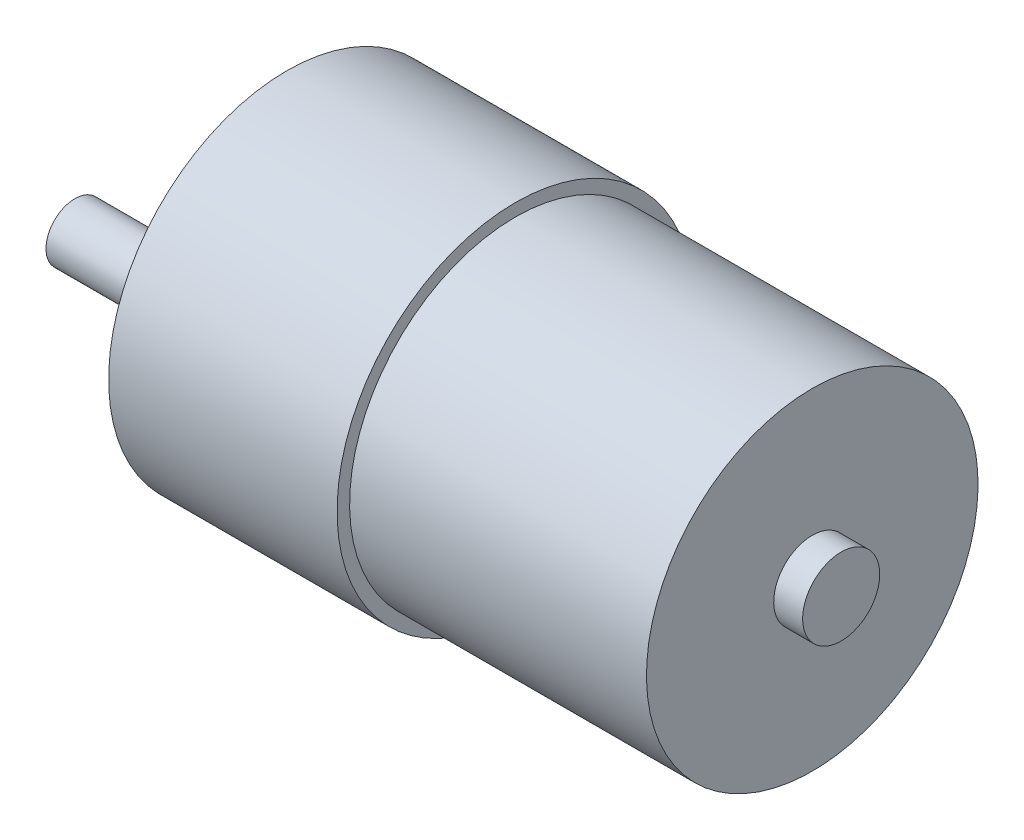
ISO-10303-21;
HEADER;
FILE_DESCRIPTION(('STEP AP214'),'2;1');
FILE_NAME('part.step','',(''),(''),'','','');
FILE_SCHEMA(('AUTOMOTIVE_DESIGN { 1 0 10303 214 1 1 1 1 }'));
ENDSEC;
DATA;
#1=APPLICATION_CONTEXT('core data for automotive mechanical design processes');
#2=APPLICATION_PROTOCOL_DEFINITION('international standard','automotive_design',2000,#1);
#3=PRODUCT_CONTEXT('',#1,'mechanical');
#4=PRODUCT('Part','Part','',(#3));
#5=PRODUCT_RELATED_PRODUCT_CATEGORY('part','',(#4));
#6=PRODUCT_DEFINITION_FORMATION('','',#4);
#7=PRODUCT_DEFINITION_CONTEXT('part definition',#1,'design');
#8=PRODUCT_DEFINITION('design','',#6,#7);
#9=PRODUCT_DEFINITION_SHAPE('','',#8);
#10=(LENGTH_UNIT() NAMED_UNIT(*) SI_UNIT(.MILLI.,.METRE.));
#11=(NAMED_UNIT(*) PLANE_ANGLE_UNIT() SI_UNIT($,.RADIAN.));
#12=(NAMED_UNIT(*) SI_UNIT($,.STERADIAN.) SOLID_ANGLE_UNIT());
#13=UNCERTAINTY_MEASURE_WITH_UNIT(LENGTH_MEASURE(1.E-05),#10,'distance_accuracy_value','');
#14=(GEOMETRIC_REPRESENTATION_CONTEXT(3) GLOBAL_UNCERTAINTY_ASSIGNED_CONTEXT((#13)) GLOBAL_UNIT_ASSIGNED_CONTEXT((#10,
#11,#12)) REPRESENTATION_CONTEXT('',''));
#15=CARTESIAN_POINT('',(0.,0.,0.));
#16=DIRECTION('',(0.,0.,1.));
#17=DIRECTION('',(1.,0.,0.));
#18=AXIS2_PLACEMENT_3D('',#15,#16,#17);
#19=CARTESIAN_POINT('',(-23.7,0.,0.));
#20=DIRECTION('',(1.,0.,0.));
#21=DIRECTION('',(0.,1.,0.));
#22=AXIS2_PLACEMENT_3D('',#19,#20,#21);
#23=PLANE('',#22);
#24=CARTESIAN_POINT('',(-23.7,-7.,0.));
#25=DIRECTION('',(-1.,0.,0.));
#26=DIRECTION('',(0.,-1.,0.));
#27=AXIS2_PLACEMENT_3D('',#24,#25,#26);
#28=CIRCLE('',#27,6.5);
#29=CARTESIAN_POINT('',(-23.7,-13.5,0.));
#30=VERTEX_POINT('',#29);
#31=EDGE_CURVE('E39',#30,#30,#28,.T.);
#32=ORIENTED_EDGE('',*,*,#31,.F.);
#33=EDGE_LOOP('',(#32));
#34=FACE_BOUND('',#33,.T.);
#35=CARTESIAN_POINT('',(-23.7,0.,0.));
#36=DIRECTION('',(1.,0.,0.));
#37=DIRECTION('',(0.,1.,0.));
#38=AXIS2_PLACEMENT_3D('',#35,#36,#37);
#39=CIRCLE('',#38,18.5);
#40=CARTESIAN_POINT('',(-23.7,18.5,0.));
#41=VERTEX_POINT('',#40);
#42=EDGE_CURVE('E50',#41,#41,#39,.T.);
#43=ORIENTED_EDGE('',*,*,#42,.F.);
#44=EDGE_LOOP('',(#43));
#45=FACE_BOUND('',#44,.T.);
#46=ADVANCED_FACE('F32',(#34,#45),#23,.F.);
#47=CARTESIAN_POINT('',(33.8,0.,0.));
#48=DIRECTION('',(-1.,0.,0.));
#49=DIRECTION('',(0.,-1.,0.));
#50=AXIS2_PLACEMENT_3D('',#47,#48,#49);
#51=PLANE('',#50);
#52=CARTESIAN_POINT('',(33.8,0.,0.));
#53=DIRECTION('',(1.,0.,0.));
#54=DIRECTION('',(0.,1.,0.));
#55=AXIS2_PLACEMENT_3D('',#52,#53,#54);
#56=CIRCLE('',#55,4.);
#57=CARTESIAN_POINT('',(33.8,4.,0.));
#58=VERTEX_POINT('',#57);
#59=EDGE_CURVE('E35',#58,#58,#56,.T.);
#60=ORIENTED_EDGE('',*,*,#59,.T.);
#61=EDGE_LOOP('',(#60));
#62=FACE_BOUND('',#61,.T.);
#63=ADVANCED_FACE('F69',(#62),#51,.F.);
#64=CARTESIAN_POINT('',(30.8,0.,0.));
#65=DIRECTION('',(1.,0.,0.));
#66=DIRECTION('',(0.,1.,0.));
#67=AXIS2_PLACEMENT_3D('',#64,#65,#66);
#68=CYLINDRICAL_SURFACE('',#67,4.);
#69=ORIENTED_EDGE('',*,*,#59,.F.);
#70=EDGE_LOOP('',(#69));
#71=FACE_BOUND('',#70,.T.);
#72=CARTESIAN_POINT('',(30.8,0.,0.));
#73=DIRECTION('',(1.,0.,0.));
#74=DIRECTION('',(0.,1.,0.));
#75=AXIS2_PLACEMENT_3D('',#72,#73,#74);
#76=CIRCLE('',#75,4.);
#77=CARTESIAN_POINT('',(30.8,4.,0.));
#78=VERTEX_POINT('',#77);
#79=EDGE_CURVE('E62',#78,#78,#76,.T.);
#80=ORIENTED_EDGE('',*,*,#79,.T.);
#81=EDGE_LOOP('',(#80));
#82=FACE_BOUND('',#81,.T.);
#83=ADVANCED_FACE('F71',(#71,#82),#68,.T.);
#84=CARTESIAN_POINT('',(30.8,0.,0.));
#85=DIRECTION('',(-1.,0.,0.));
#86=DIRECTION('',(0.,-1.,0.));
#87=AXIS2_PLACEMENT_3D('',#84,#85,#86);
#88=PLANE('',#87);
#89=ORIENTED_EDGE('',*,*,#79,.F.);
#90=EDGE_LOOP('',(#89));
#91=FACE_BOUND('',#90,.T.);
#92=CARTESIAN_POINT('',(30.8,0.,0.));
#93=DIRECTION('',(1.,0.,0.));
#94=DIRECTION('',(0.,1.,0.));
#95=AXIS2_PLACEMENT_3D('',#92,#93,#94);
#96=CIRCLE('',#95,17.2);
#97=CARTESIAN_POINT('',(30.8,17.2,0.));
#98=VERTEX_POINT('',#97);
#99=EDGE_CURVE('E60',#98,#98,#96,.T.);
#100=ORIENTED_EDGE('',*,*,#99,.T.);
#101=EDGE_LOOP('',(#100));
#102=FACE_BOUND('',#101,.T.);
#103=ADVANCED_FACE('F73',(#91,#102),#88,.F.);
#104=CARTESIAN_POINT('',(30.8,0.,0.));
#105=DIRECTION('',(1.,0.,0.));
#106=DIRECTION('',(0.,1.,0.));
#107=AXIS2_PLACEMENT_3D('',#104,#105,#106);
#108=CYLINDRICAL_SURFACE('',#107,17.2);
#109=ORIENTED_EDGE('',*,*,#99,.F.);
#110=EDGE_LOOP('',(#109));
#111=FACE_BOUND('',#110,.T.);
#112=CARTESIAN_POINT('',(0.,0.,0.));
#113=DIRECTION('',(1.,0.,0.));
#114=DIRECTION('',(0.,1.,0.));
#115=AXIS2_PLACEMENT_3D('',#112,#113,#114);
#116=CIRCLE('',#115,17.2);
#117=CARTESIAN_POINT('',(0.,17.2,0.));
#118=VERTEX_POINT('',#117);
#119=EDGE_CURVE('E57',#118,#118,#116,.T.);
#120=ORIENTED_EDGE('',*,*,#119,.T.);
#121=EDGE_LOOP('',(#120));
#122=FACE_BOUND('',#121,.T.);
#123=ADVANCED_FACE('F79',(#111,#122),#108,.T.);
#124=CARTESIAN_POINT('',(0.,0.,0.));
#125=DIRECTION('',(1.,0.,0.));
#126=DIRECTION('',(0.,1.,0.));
#127=AXIS2_PLACEMENT_3D('',#124,#125,#126);
#128=PLANE('',#127);
#129=CARTESIAN_POINT('',(0.,0.,0.));
#130=DIRECTION('',(1.,0.,0.));
#131=DIRECTION('',(0.,1.,0.));
#132=AXIS2_PLACEMENT_3D('',#129,#130,#131);
#133=CIRCLE('',#132,18.5);
#134=CARTESIAN_POINT('',(0.,18.5,0.));
#135=VERTEX_POINT('',#134);
#136=EDGE_CURVE('E54',#135,#135,#133,.T.);
#137=ORIENTED_EDGE('',*,*,#136,.T.);
#138=EDGE_LOOP('',(#137));
#139=FACE_BOUND('',#138,.T.);
#140=ORIENTED_EDGE('',*,*,#119,.F.);
#141=EDGE_LOOP('',(#140));
#142=FACE_BOUND('',#141,.T.);
#143=ADVANCED_FACE('F94',(#139,#142),#128,.T.);
#144=CARTESIAN_POINT('',(30.8,0.,0.));
#145=DIRECTION('',(1.,0.,0.));
#146=DIRECTION('',(0.,1.,0.));
#147=AXIS2_PLACEMENT_3D('',#144,#145,#146);
#148=CYLINDRICAL_SURFACE('',#147,18.5);
#149=ORIENTED_EDGE('',*,*,#42,.T.);
#150=EDGE_LOOP('',(#149));
#151=FACE_BOUND('',#150,.T.);
#152=ORIENTED_EDGE('',*,*,#136,.F.);
#153=EDGE_LOOP('',(#152));
#154=FACE_BOUND('',#153,.T.);
#155=ADVANCED_FACE('F90',(#151,#154),#148,.T.);
#156=CARTESIAN_POINT('',(-30.7,-7.,0.));
#157=DIRECTION('',(1.,0.,0.));
#158=DIRECTION('',(0.,1.,0.));
#159=AXIS2_PLACEMENT_3D('',#156,#157,#158);
#160=CYLINDRICAL_SURFACE('',#159,6.5);
#161=CARTESIAN_POINT('',(-30.7,-7.,0.));
#162=DIRECTION('',(-1.,0.,0.));
#163=DIRECTION('',(0.,-1.,0.));
#164=AXIS2_PLACEMENT_3D('',#161,#162,#163);
#165=CIRCLE('',#164,6.5);
#166=CARTESIAN_POINT('',(-30.7,-13.5,0.));
#167=VERTEX_POINT('',#166);
#168=EDGE_CURVE('E48',#167,#167,#165,.T.);
#169=ORIENTED_EDGE('',*,*,#168,.F.);
#170=EDGE_LOOP('',(#169));
#171=FACE_BOUND('',#170,.T.);
#172=ORIENTED_EDGE('',*,*,#31,.T.);
#173=EDGE_LOOP('',(#172));
#174=FACE_BOUND('',#173,.T.);
#175=ADVANCED_FACE('F93',(#171,#174),#160,.T.);
#176=CARTESIAN_POINT('',(-30.7,-7.,0.));
#177=DIRECTION('',(-1.,0.,0.));
#178=DIRECTION('',(0.,-1.,0.));
#179=AXIS2_PLACEMENT_3D('',#176,#177,#178);
#180=PLANE('',#179);
#181=CARTESIAN_POINT('',(-30.7,-7.,0.));
#182=DIRECTION('',(-1.,0.,0.));
#183=DIRECTION('',(0.,-1.,0.));
#184=AXIS2_PLACEMENT_3D('',#181,#182,#183);
#185=CIRCLE('',#184,3.);
#186=CARTESIAN_POINT('',(-30.7,-10.,0.));
#187=VERTEX_POINT('',#186);
#188=EDGE_CURVE('E10',#187,#187,#185,.T.);
#189=ORIENTED_EDGE('',*,*,#188,.F.);
#190=EDGE_LOOP('',(#189));
#191=FACE_BOUND('',#190,.T.);
#192=ORIENTED_EDGE('',*,*,#168,.T.);
#193=EDGE_LOOP('',(#192));
#194=FACE_BOUND('',#193,.T.);
#195=ADVANCED_FACE('F112',(#191,#194),#180,.T.);
#196=CARTESIAN_POINT('',(-45.7,-7.,0.));
#197=DIRECTION('',(1.,0.,0.));
#198=DIRECTION('',(0.,1.,0.));
#199=AXIS2_PLACEMENT_3D('',#196,#197,#198);
#200=CYLINDRICAL_SURFACE('',#199,3.);
#201=CARTESIAN_POINT('',(-45.7,-7.,0.));
#202=DIRECTION('',(-1.,0.,0.));
#203=DIRECTION('',(0.,-1.,0.));
#204=AXIS2_PLACEMENT_3D('',#201,#202,#203);
#205=CIRCLE('',#204,3.);
#206=CARTESIAN_POINT('',(-45.7,-10.,0.));
#207=VERTEX_POINT('',#206);
#208=EDGE_CURVE('E47',#207,#207,#205,.T.);
#209=ORIENTED_EDGE('',*,*,#208,.F.);
#210=EDGE_LOOP('',(#209));
#211=FACE_BOUND('',#210,.T.);
#212=ORIENTED_EDGE('',*,*,#188,.T.);
#213=EDGE_LOOP('',(#212));
#214=FACE_BOUND('',#213,.T.);
#215=ADVANCED_FACE('F116',(#211,#214),#200,.T.);
#216=CARTESIAN_POINT('',(-45.7,-7.,0.));
#217=DIRECTION('',(-1.,0.,0.));
#218=DIRECTION('',(0.,-1.,0.));
#219=AXIS2_PLACEMENT_3D('',#216,#217,#218);
#220=PLANE('',#219);
#221=ORIENTED_EDGE('',*,*,#208,.T.);
#222=EDGE_LOOP('',(#221));
#223=FACE_BOUND('',#222,.T.);
#224=ADVANCED_FACE('F120',(#223),#220,.T.);
#225=CLOSED_SHELL('',(#46,#63,#83,#103,#123,#143,#155,#175,#195,#215,#224));
#226=MANIFOLD_SOLID_BREP('B2',#225);
#227=ADVANCED_BREP_SHAPE_REPRESENTATION('',(#18,#226),#14);
#228=SHAPE_DEFINITION_REPRESENTATION(#9,#227);
ENDSEC;
END-ISO-10303-21;
